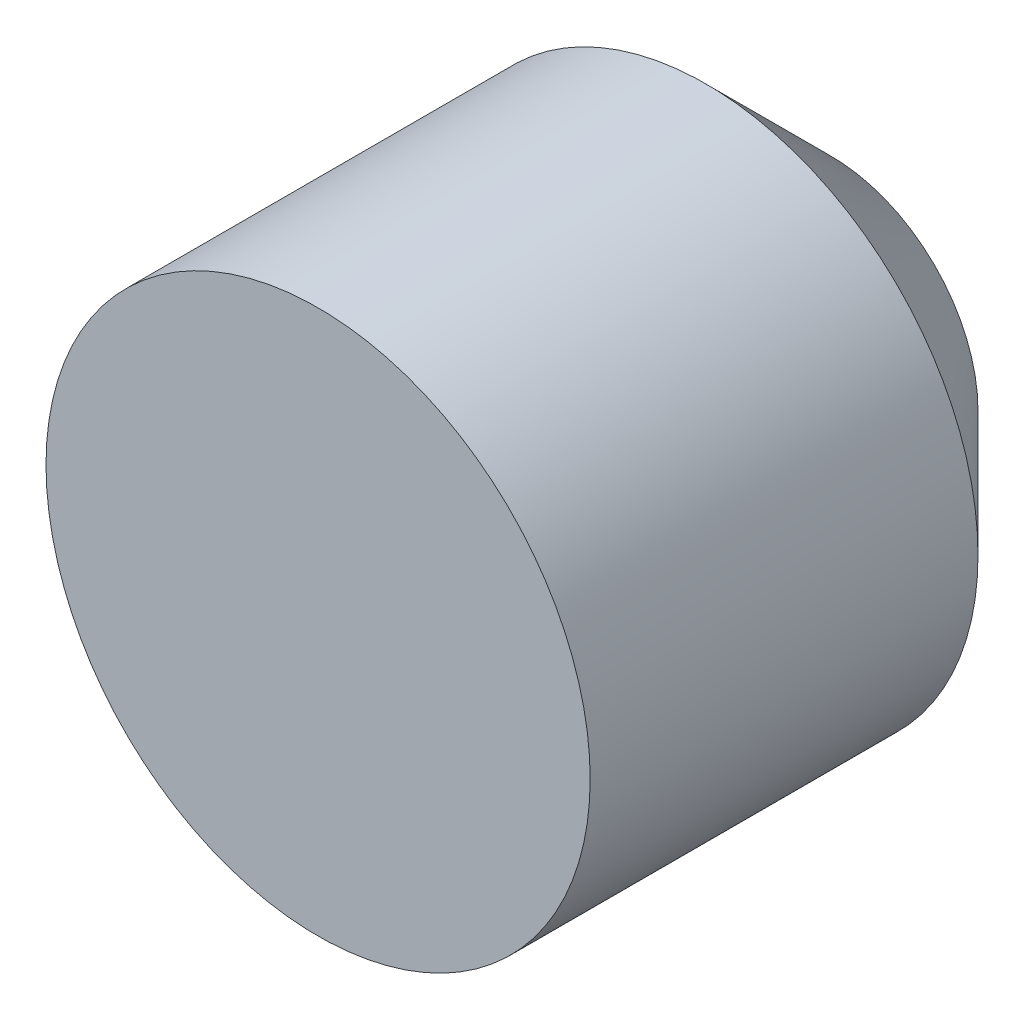
ISO-10303-21;
HEADER;
FILE_DESCRIPTION(('STEP AP214'),'2;1');
FILE_NAME('part.step','',(''),(''),'','','');
FILE_SCHEMA(('AUTOMOTIVE_DESIGN { 1 0 10303 214 1 1 1 1 }'));
ENDSEC;
DATA;
#1=APPLICATION_CONTEXT('core data for automotive mechanical design processes');
#2=APPLICATION_PROTOCOL_DEFINITION('international standard','automotive_design',2000,#1);
#3=PRODUCT_CONTEXT('',#1,'mechanical');
#4=PRODUCT('Part','Part','',(#3));
#5=PRODUCT_RELATED_PRODUCT_CATEGORY('part','',(#4));
#6=PRODUCT_DEFINITION_FORMATION('','',#4);
#7=PRODUCT_DEFINITION_CONTEXT('part definition',#1,'design');
#8=PRODUCT_DEFINITION('design','',#6,#7);
#9=PRODUCT_DEFINITION_SHAPE('','',#8);
#10=(LENGTH_UNIT() NAMED_UNIT(*) SI_UNIT(.MILLI.,.METRE.));
#11=(NAMED_UNIT(*) PLANE_ANGLE_UNIT() SI_UNIT($,.RADIAN.));
#12=(NAMED_UNIT(*) SI_UNIT($,.STERADIAN.) SOLID_ANGLE_UNIT());
#13=UNCERTAINTY_MEASURE_WITH_UNIT(LENGTH_MEASURE(1.E-05),#10,'distance_accuracy_value','');
#14=(GEOMETRIC_REPRESENTATION_CONTEXT(3) GLOBAL_UNCERTAINTY_ASSIGNED_CONTEXT((#13)) GLOBAL_UNIT_ASSIGNED_CONTEXT((#10,
#11,#12)) REPRESENTATION_CONTEXT('',''));
#15=CARTESIAN_POINT('',(0.,0.,0.));
#16=DIRECTION('',(0.,0.,1.));
#17=DIRECTION('',(1.,0.,0.));
#18=AXIS2_PLACEMENT_3D('',#15,#16,#17);
#19=CARTESIAN_POINT('',(0.,0.,41.));
#20=DIRECTION('',(0.,0.,-1.));
#21=DIRECTION('',(-1.,0.,0.));
#22=AXIS2_PLACEMENT_3D('',#19,#20,#21);
#23=CYLINDRICAL_SURFACE('',#22,21.75);
#24=CARTESIAN_POINT('',(0.,0.,10.));
#25=DIRECTION('',(0.,0.,1.));
#26=DIRECTION('',(1.,0.,0.));
#27=AXIS2_PLACEMENT_3D('',#24,#25,#26);
#28=CIRCLE('',#27,21.75);
#29=CARTESIAN_POINT('',(21.75,0.,10.));
#30=VERTEX_POINT('',#29);
#31=EDGE_CURVE('E52',#30,#30,#28,.T.);
#32=ORIENTED_EDGE('',*,*,#31,.T.);
#33=EDGE_LOOP('',(#32));
#34=FACE_BOUND('',#33,.T.);
#35=CARTESIAN_POINT('',(0.,0.,41.));
#36=DIRECTION('',(0.,0.,1.));
#37=DIRECTION('',(1.,0.,0.));
#38=AXIS2_PLACEMENT_3D('',#35,#36,#37);
#39=CIRCLE('',#38,21.75);
#40=CARTESIAN_POINT('',(21.75,0.,41.));
#41=VERTEX_POINT('',#40);
#42=EDGE_CURVE('E57',#41,#41,#39,.T.);
#43=ORIENTED_EDGE('',*,*,#42,.F.);
#44=EDGE_LOOP('',(#43));
#45=FACE_BOUND('',#44,.T.);
#46=ADVANCED_FACE('F43',(#34,#45),#23,.T.);
#47=CARTESIAN_POINT('',(0.,0.,41.));
#48=DIRECTION('',(0.,0.,1.));
#49=DIRECTION('',(1.,0.,0.));
#50=AXIS2_PLACEMENT_3D('',#47,#48,#49);
#51=PLANE('',#50);
#52=ORIENTED_EDGE('',*,*,#42,.T.);
#53=EDGE_LOOP('',(#52));
#54=FACE_BOUND('',#53,.T.);
#55=ADVANCED_FACE('F65',(#54),#51,.T.);
#56=CARTESIAN_POINT('',(0.,0.,0.));
#57=DIRECTION('',(0.,0.,1.));
#58=DIRECTION('',(1.,0.,0.));
#59=AXIS2_PLACEMENT_3D('',#56,#57,#58);
#60=PLANE('',#59);
#61=CARTESIAN_POINT('',(0.,0.,0.));
#62=DIRECTION('',(0.,0.,1.));
#63=DIRECTION('',(1.,0.,0.));
#64=AXIS2_PLACEMENT_3D('',#61,#62,#63);
#65=CIRCLE('',#64,11.75);
#66=CARTESIAN_POINT('',(11.75,0.,0.));
#67=VERTEX_POINT('',#66);
#68=EDGE_CURVE('E10',#67,#67,#65,.F.);
#69=ORIENTED_EDGE('',*,*,#68,.T.);
#70=EDGE_LOOP('',(#69));
#71=FACE_BOUND('',#70,.T.);
#72=ADVANCED_FACE('F71',(#71),#60,.F.);
#73=CARTESIAN_POINT('',(0.,0.,10.));
#74=DIRECTION('',(0.,0.,1.));
#75=DIRECTION('',(1.,0.,0.));
#76=AXIS2_PLACEMENT_3D('',#73,#74,#75);
#77=CONICAL_SURFACE('',#76,21.75,0.78539816339745);
#78=ORIENTED_EDGE('',*,*,#68,.F.);
#79=EDGE_LOOP('',(#78));
#80=FACE_BOUND('',#79,.T.);
#81=ORIENTED_EDGE('',*,*,#31,.F.);
#82=EDGE_LOOP('',(#81));
#83=FACE_BOUND('',#82,.T.);
#84=ADVANCED_FACE('F46',(#80,#83),#77,.T.);
#85=CLOSED_SHELL('',(#46,#55,#72,#84));
#86=MANIFOLD_SOLID_BREP('B2',#85);
#87=ADVANCED_BREP_SHAPE_REPRESENTATION('',(#18,#86),#14);
#88=SHAPE_DEFINITION_REPRESENTATION(#9,#87);
ENDSEC;
END-ISO-10303-21;
